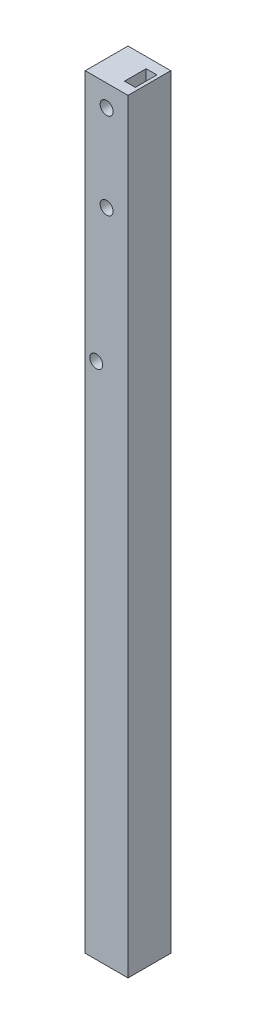
ISO-10303-21;
HEADER;
FILE_DESCRIPTION(('STEP AP214'),'2;1');
FILE_NAME('part.step','',(''),(''),'','','');
FILE_SCHEMA(('AUTOMOTIVE_DESIGN { 1 0 10303 214 1 1 1 1 }'));
ENDSEC;
DATA;
#1=APPLICATION_CONTEXT('core data for automotive mechanical design processes');
#2=APPLICATION_PROTOCOL_DEFINITION('international standard','automotive_design',2000,#1);
#3=PRODUCT_CONTEXT('',#1,'mechanical');
#4=PRODUCT('Part','Part','',(#3));
#5=PRODUCT_RELATED_PRODUCT_CATEGORY('part','',(#4));
#6=PRODUCT_DEFINITION_FORMATION('','',#4);
#7=PRODUCT_DEFINITION_CONTEXT('part definition',#1,'design');
#8=PRODUCT_DEFINITION('design','',#6,#7);
#9=PRODUCT_DEFINITION_SHAPE('','',#8);
#10=(LENGTH_UNIT() NAMED_UNIT(*) SI_UNIT(.MILLI.,.METRE.));
#11=(NAMED_UNIT(*) PLANE_ANGLE_UNIT() SI_UNIT($,.RADIAN.));
#12=(NAMED_UNIT(*) SI_UNIT($,.STERADIAN.) SOLID_ANGLE_UNIT());
#13=UNCERTAINTY_MEASURE_WITH_UNIT(LENGTH_MEASURE(1.E-05),#10,'distance_accuracy_value','');
#14=(GEOMETRIC_REPRESENTATION_CONTEXT(3) GLOBAL_UNCERTAINTY_ASSIGNED_CONTEXT((#13)) GLOBAL_UNIT_ASSIGNED_CONTEXT((#10,
#11,#12)) REPRESENTATION_CONTEXT('',''));
#15=CARTESIAN_POINT('',(0.,0.,0.));
#16=DIRECTION('',(0.,0.,1.));
#17=DIRECTION('',(1.,0.,0.));
#18=AXIS2_PLACEMENT_3D('',#15,#16,#17);
#19=CARTESIAN_POINT('',(0.,177.,0.));
#20=DIRECTION('',(0.,1.,0.));
#21=DIRECTION('',(0.,0.,1.));
#22=AXIS2_PLACEMENT_3D('',#19,#20,#21);
#23=PLANE('',#22);
#24=DIRECTION('',(0.,0.,1.));
#25=VECTOR('',#24,1.);
#26=CARTESIAN_POINT('',(-5.69475822086397,177.,5.05825853992586));
#27=LINE('',#26,#25);
#28=CARTESIAN_POINT('',(-5.69475822086397,177.,-4.84174146007414));
#29=VERTEX_POINT('',#28);
#30=CARTESIAN_POINT('',(-5.69475822086397,177.,5.05825853992586));
#31=VERTEX_POINT('',#30);
#32=EDGE_CURVE('E138',#29,#31,#27,.T.);
#33=ORIENTED_EDGE('',*,*,#32,.T.);
#34=DIRECTION('',(1.,0.,0.));
#35=VECTOR('',#34,1.);
#36=CARTESIAN_POINT('',(4.20524177913603,177.,5.05825853992586));
#37=LINE('',#36,#35);
#38=CARTESIAN_POINT('',(4.20524177913603,177.,5.05825853992586));
#39=VERTEX_POINT('',#38);
#40=EDGE_CURVE('E141',#31,#39,#37,.T.);
#41=ORIENTED_EDGE('',*,*,#40,.T.);
#42=DIRECTION('',(0.,0.,-1.));
#43=VECTOR('',#42,1.);
#44=CARTESIAN_POINT('',(4.20524177913603,177.,5.05825853992586));
#45=LINE('',#44,#43);
#46=CARTESIAN_POINT('',(4.20524177913603,177.,-4.84174146007415));
#47=VERTEX_POINT('',#46);
#48=EDGE_CURVE('E144',#39,#47,#45,.T.);
#49=ORIENTED_EDGE('',*,*,#48,.T.);
#50=DIRECTION('',(-1.,0.,0.));
#51=VECTOR('',#50,1.);
#52=CARTESIAN_POINT('',(4.20524177913603,177.,-4.84174146007415));
#53=LINE('',#52,#51);
#54=EDGE_CURVE('E146',#47,#29,#53,.T.);
#55=ORIENTED_EDGE('',*,*,#54,.T.);
#56=EDGE_LOOP('',(#33,#41,#49,#55));
#57=FACE_BOUND('',#56,.T.);
#58=DIRECTION('',(-1.,0.,0.));
#59=VECTOR('',#58,1.);
#60=CARTESIAN_POINT('',(0.955241779136031,177.,-2.39174146007414));
#61=LINE('',#60,#59);
#62=CARTESIAN_POINT('',(3.45524177913603,177.,-2.39174146007414));
#63=VERTEX_POINT('',#62);
#64=CARTESIAN_POINT('',(0.955241779136031,177.,-2.39174146007414));
#65=VERTEX_POINT('',#64);
#66=EDGE_CURVE('E108',#63,#65,#61,.T.);
#67=ORIENTED_EDGE('',*,*,#66,.F.);
#68=DIRECTION('',(0.,0.,-1.));
#69=VECTOR('',#68,1.);
#70=CARTESIAN_POINT('',(3.45524177913603,177.,-2.39174146007414));
#71=LINE('',#70,#69);
#72=CARTESIAN_POINT('',(3.45524177913603,177.,2.60825853992586));
#73=VERTEX_POINT('',#72);
#74=EDGE_CURVE('E100',#73,#63,#71,.T.);
#75=ORIENTED_EDGE('',*,*,#74,.F.);
#76=DIRECTION('',(1.,0.,0.));
#77=VECTOR('',#76,1.);
#78=CARTESIAN_POINT('',(0.955241779136031,177.,2.60825853992586));
#79=LINE('',#78,#77);
#80=CARTESIAN_POINT('',(0.955241779136031,177.,2.60825853992586));
#81=VERTEX_POINT('',#80);
#82=EDGE_CURVE('E122',#81,#73,#79,.T.);
#83=ORIENTED_EDGE('',*,*,#82,.F.);
#84=DIRECTION('',(0.,0.,1.));
#85=VECTOR('',#84,1.);
#86=CARTESIAN_POINT('',(0.955241779136031,177.,-2.39174146007414));
#87=LINE('',#86,#85);
#88=EDGE_CURVE('E120',#65,#81,#87,.T.);
#89=ORIENTED_EDGE('',*,*,#88,.F.);
#90=EDGE_LOOP('',(#67,#75,#83,#89));
#91=FACE_BOUND('',#90,.T.);
#92=ADVANCED_FACE('F35',(#57,#91),#23,.T.);
#93=CARTESIAN_POINT('',(0.,0.,0.));
#94=DIRECTION('',(0.,1.,0.));
#95=DIRECTION('',(0.,0.,1.));
#96=AXIS2_PLACEMENT_3D('',#93,#94,#95);
#97=PLANE('',#96);
#98=DIRECTION('',(0.,0.,1.));
#99=VECTOR('',#98,1.);
#100=CARTESIAN_POINT('',(-5.69475822086397,0.,5.05825853992586));
#101=LINE('',#100,#99);
#102=CARTESIAN_POINT('',(-5.69475822086397,0.,-4.84174146007414));
#103=VERTEX_POINT('',#102);
#104=CARTESIAN_POINT('',(-5.69475822086397,0.,5.05825853992586));
#105=VERTEX_POINT('',#104);
#106=EDGE_CURVE('E116',#103,#105,#101,.T.);
#107=ORIENTED_EDGE('',*,*,#106,.F.);
#108=DIRECTION('',(-1.,0.,0.));
#109=VECTOR('',#108,1.);
#110=CARTESIAN_POINT('',(4.20524177913603,0.,-4.84174146007415));
#111=LINE('',#110,#109);
#112=CARTESIAN_POINT('',(4.20524177913603,0.,-4.84174146007415));
#113=VERTEX_POINT('',#112);
#114=EDGE_CURVE('E142',#113,#103,#111,.T.);
#115=ORIENTED_EDGE('',*,*,#114,.F.);
#116=DIRECTION('',(0.,0.,-1.));
#117=VECTOR('',#116,1.);
#118=CARTESIAN_POINT('',(4.20524177913603,0.,5.05825853992586));
#119=LINE('',#118,#117);
#120=CARTESIAN_POINT('',(4.20524177913603,0.,5.05825853992586));
#121=VERTEX_POINT('',#120);
#122=EDGE_CURVE('E153',#121,#113,#119,.T.);
#123=ORIENTED_EDGE('',*,*,#122,.F.);
#124=DIRECTION('',(1.,0.,0.));
#125=VECTOR('',#124,1.);
#126=CARTESIAN_POINT('',(4.20524177913603,0.,5.05825853992586));
#127=LINE('',#126,#125);
#128=EDGE_CURVE('E151',#105,#121,#127,.T.);
#129=ORIENTED_EDGE('',*,*,#128,.F.);
#130=EDGE_LOOP('',(#107,#115,#123,#129));
#131=FACE_BOUND('',#130,.T.);
#132=DIRECTION('',(0.,0.,-1.));
#133=VECTOR('',#132,1.);
#134=CARTESIAN_POINT('',(3.45524177913603,0.,-2.39174146007414));
#135=LINE('',#134,#133);
#136=CARTESIAN_POINT('',(3.45524177913603,0.,2.60825853992586));
#137=VERTEX_POINT('',#136);
#138=CARTESIAN_POINT('',(3.45524177913603,0.,-2.39174146007414));
#139=VERTEX_POINT('',#138);
#140=EDGE_CURVE('E58',#137,#139,#135,.T.);
#141=ORIENTED_EDGE('',*,*,#140,.T.);
#142=DIRECTION('',(-1.,0.,0.));
#143=VECTOR('',#142,1.);
#144=CARTESIAN_POINT('',(0.955241779136031,0.,-2.39174146007414));
#145=LINE('',#144,#143);
#146=CARTESIAN_POINT('',(0.955241779136031,0.,-2.39174146007414));
#147=VERTEX_POINT('',#146);
#148=EDGE_CURVE('E115',#139,#147,#145,.T.);
#149=ORIENTED_EDGE('',*,*,#148,.T.);
#150=DIRECTION('',(0.,0.,1.));
#151=VECTOR('',#150,1.);
#152=CARTESIAN_POINT('',(0.955241779136031,0.,-2.39174146007414));
#153=LINE('',#152,#151);
#154=CARTESIAN_POINT('',(0.955241779136031,0.,2.60825853992586));
#155=VERTEX_POINT('',#154);
#156=EDGE_CURVE('E130',#147,#155,#153,.T.);
#157=ORIENTED_EDGE('',*,*,#156,.T.);
#158=DIRECTION('',(1.,0.,0.));
#159=VECTOR('',#158,1.);
#160=CARTESIAN_POINT('',(0.955241779136031,0.,2.60825853992586));
#161=LINE('',#160,#159);
#162=EDGE_CURVE('E109',#155,#137,#161,.T.);
#163=ORIENTED_EDGE('',*,*,#162,.T.);
#164=EDGE_LOOP('',(#141,#149,#157,#163));
#165=FACE_BOUND('',#164,.T.);
#166=ADVANCED_FACE('F171',(#131,#165),#97,.F.);
#167=CARTESIAN_POINT('',(-5.69475822086397,177.,5.05825853992586));
#168=DIRECTION('',(1.,0.,0.));
#169=DIRECTION('',(0.,0.,-1.));
#170=AXIS2_PLACEMENT_3D('',#167,#168,#169);
#171=PLANE('',#170);
#172=ORIENTED_EDGE('',*,*,#106,.T.);
#173=DIRECTION('',(0.,-1.,0.));
#174=VECTOR('',#173,1.);
#175=CARTESIAN_POINT('',(-5.69475822086397,177.,5.05825853992586));
#176=LINE('',#175,#174);
#177=EDGE_CURVE('E11',#31,#105,#176,.T.);
#178=ORIENTED_EDGE('',*,*,#177,.F.);
#179=ORIENTED_EDGE('',*,*,#32,.F.);
#180=DIRECTION('',(0.,-1.,0.));
#181=VECTOR('',#180,1.);
#182=CARTESIAN_POINT('',(-5.69475822086397,177.,-4.84174146007414));
#183=LINE('',#182,#181);
#184=EDGE_CURVE('E148',#29,#103,#183,.T.);
#185=ORIENTED_EDGE('',*,*,#184,.T.);
#186=EDGE_LOOP('',(#172,#178,#179,#185));
#187=FACE_BOUND('',#186,.T.);
#188=ADVANCED_FACE('F37',(#187),#171,.F.);
#189=CARTESIAN_POINT('',(4.20524177913603,177.,5.05825853992586));
#190=DIRECTION('',(0.,0.,-1.));
#191=DIRECTION('',(-1.,0.,0.));
#192=AXIS2_PLACEMENT_3D('',#189,#190,#191);
#193=PLANE('',#192);
#194=CARTESIAN_POINT('',(-3.14475822086397,120.,5.05825853992586));
#195=DIRECTION('',(0.,0.,-1.));
#196=DIRECTION('',(-1.,0.,0.));
#197=AXIS2_PLACEMENT_3D('',#194,#195,#196);
#198=CIRCLE('',#197,1.5);
#199=CARTESIAN_POINT('',(-4.64475822086397,120.,5.05825853992586));
#200=VERTEX_POINT('',#199);
#201=EDGE_CURVE('E217',#200,#200,#198,.T.);
#202=ORIENTED_EDGE('',*,*,#201,.T.);
#203=EDGE_LOOP('',(#202));
#204=FACE_BOUND('',#203,.T.);
#205=CARTESIAN_POINT('',(-0.744758220863973,152.,5.05825853992586));
#206=DIRECTION('',(0.,0.,-1.));
#207=DIRECTION('',(-1.,0.,0.));
#208=AXIS2_PLACEMENT_3D('',#205,#206,#207);
#209=CIRCLE('',#208,1.5);
#210=CARTESIAN_POINT('',(-2.24475822086397,152.,5.05825853992586));
#211=VERTEX_POINT('',#210);
#212=EDGE_CURVE('E223',#211,#211,#209,.T.);
#213=ORIENTED_EDGE('',*,*,#212,.T.);
#214=EDGE_LOOP('',(#213));
#215=FACE_BOUND('',#214,.T.);
#216=CARTESIAN_POINT('',(-0.744758220863949,172.,5.05825853992586));
#217=DIRECTION('',(0.,0.,-1.));
#218=DIRECTION('',(-1.,0.,0.));
#219=AXIS2_PLACEMENT_3D('',#216,#217,#218);
#220=CIRCLE('',#219,1.5);
#221=CARTESIAN_POINT('',(-2.24475822086395,172.,5.05825853992586));
#222=VERTEX_POINT('',#221);
#223=EDGE_CURVE('E128',#222,#222,#220,.T.);
#224=ORIENTED_EDGE('',*,*,#223,.T.);
#225=EDGE_LOOP('',(#224));
#226=FACE_BOUND('',#225,.T.);
#227=ORIENTED_EDGE('',*,*,#128,.T.);
#228=DIRECTION('',(0.,-1.,0.));
#229=VECTOR('',#228,1.);
#230=CARTESIAN_POINT('',(4.20524177913603,177.,5.05825853992586));
#231=LINE('',#230,#229);
#232=EDGE_CURVE('E43',#39,#121,#231,.T.);
#233=ORIENTED_EDGE('',*,*,#232,.F.);
#234=ORIENTED_EDGE('',*,*,#40,.F.);
#235=ORIENTED_EDGE('',*,*,#177,.T.);
#236=EDGE_LOOP('',(#227,#233,#234,#235));
#237=FACE_BOUND('',#236,.T.);
#238=ADVANCED_FACE('F181',(#204,#215,#226,#237),#193,.F.);
#239=CARTESIAN_POINT('',(4.20524177913603,177.,5.05825853992586));
#240=DIRECTION('',(-1.,0.,0.));
#241=DIRECTION('',(0.,0.,1.));
#242=AXIS2_PLACEMENT_3D('',#239,#240,#241);
#243=PLANE('',#242);
#244=ORIENTED_EDGE('',*,*,#122,.T.);
#245=DIRECTION('',(0.,-1.,0.));
#246=VECTOR('',#245,1.);
#247=CARTESIAN_POINT('',(4.20524177913603,177.,-4.84174146007415));
#248=LINE('',#247,#246);
#249=EDGE_CURVE('E158',#47,#113,#248,.T.);
#250=ORIENTED_EDGE('',*,*,#249,.F.);
#251=ORIENTED_EDGE('',*,*,#48,.F.);
#252=ORIENTED_EDGE('',*,*,#232,.T.);
#253=EDGE_LOOP('',(#244,#250,#251,#252));
#254=FACE_BOUND('',#253,.T.);
#255=ADVANCED_FACE('F165',(#254),#243,.F.);
#256=CARTESIAN_POINT('',(4.20524177913603,177.,-4.84174146007415));
#257=DIRECTION('',(0.,0.,1.));
#258=DIRECTION('',(1.,0.,0.));
#259=AXIS2_PLACEMENT_3D('',#256,#257,#258);
#260=PLANE('',#259);
#261=CARTESIAN_POINT('',(-3.14475822086397,120.,-4.84174146007414));
#262=DIRECTION('',(0.,0.,-1.));
#263=DIRECTION('',(-1.,0.,0.));
#264=AXIS2_PLACEMENT_3D('',#261,#262,#263);
#265=CIRCLE('',#264,1.5);
#266=CARTESIAN_POINT('',(-4.64475822086397,120.,-4.84174146007414));
#267=VERTEX_POINT('',#266);
#268=EDGE_CURVE('E208',#267,#267,#265,.T.);
#269=ORIENTED_EDGE('',*,*,#268,.F.);
#270=EDGE_LOOP('',(#269));
#271=FACE_BOUND('',#270,.T.);
#272=CARTESIAN_POINT('',(-0.744758220863975,152.,-4.84174146007415));
#273=DIRECTION('',(0.,0.,-1.));
#274=DIRECTION('',(-1.,0.,0.));
#275=AXIS2_PLACEMENT_3D('',#272,#273,#274);
#276=CIRCLE('',#275,1.5);
#277=CARTESIAN_POINT('',(-2.24475822086398,152.,-4.84174146007415));
#278=VERTEX_POINT('',#277);
#279=EDGE_CURVE('E212',#278,#278,#276,.T.);
#280=ORIENTED_EDGE('',*,*,#279,.F.);
#281=EDGE_LOOP('',(#280));
#282=FACE_BOUND('',#281,.T.);
#283=CARTESIAN_POINT('',(-0.74475822086395,172.,-4.84174146007415));
#284=DIRECTION('',(0.,0.,-1.));
#285=DIRECTION('',(-1.,0.,0.));
#286=AXIS2_PLACEMENT_3D('',#283,#284,#285);
#287=CIRCLE('',#286,1.5);
#288=CARTESIAN_POINT('',(-2.24475822086395,172.,-4.84174146007415));
#289=VERTEX_POINT('',#288);
#290=EDGE_CURVE('E215',#289,#289,#287,.T.);
#291=ORIENTED_EDGE('',*,*,#290,.F.);
#292=EDGE_LOOP('',(#291));
#293=FACE_BOUND('',#292,.T.);
#294=ORIENTED_EDGE('',*,*,#114,.T.);
#295=ORIENTED_EDGE('',*,*,#184,.F.);
#296=ORIENTED_EDGE('',*,*,#54,.F.);
#297=ORIENTED_EDGE('',*,*,#249,.T.);
#298=EDGE_LOOP('',(#294,#295,#296,#297));
#299=FACE_BOUND('',#298,.T.);
#300=ADVANCED_FACE('F175',(#271,#282,#293,#299),#260,.F.);
#301=CARTESIAN_POINT('',(3.45524177913603,177.,-2.39174146007414));
#302=DIRECTION('',(-1.,0.,0.));
#303=DIRECTION('',(0.,0.,1.));
#304=AXIS2_PLACEMENT_3D('',#301,#302,#303);
#305=PLANE('',#304);
#306=ORIENTED_EDGE('',*,*,#140,.F.);
#307=DIRECTION('',(0.,-1.,0.));
#308=VECTOR('',#307,1.);
#309=CARTESIAN_POINT('',(3.45524177913603,177.,2.60825853992586));
#310=LINE('',#309,#308);
#311=EDGE_CURVE('E104',#73,#137,#310,.T.);
#312=ORIENTED_EDGE('',*,*,#311,.F.);
#313=ORIENTED_EDGE('',*,*,#74,.T.);
#314=DIRECTION('',(0.,-1.,0.));
#315=VECTOR('',#314,1.);
#316=CARTESIAN_POINT('',(3.45524177913603,177.,-2.39174146007414));
#317=LINE('',#316,#315);
#318=EDGE_CURVE('E103',#63,#139,#317,.T.);
#319=ORIENTED_EDGE('',*,*,#318,.T.);
#320=EDGE_LOOP('',(#306,#312,#313,#319));
#321=FACE_BOUND('',#320,.T.);
#322=ADVANCED_FACE('F102',(#321),#305,.T.);
#323=CARTESIAN_POINT('',(0.955241779136031,177.,-2.39174146007414));
#324=DIRECTION('',(0.,0.,1.));
#325=DIRECTION('',(1.,0.,0.));
#326=AXIS2_PLACEMENT_3D('',#323,#324,#325);
#327=PLANE('',#326);
#328=ORIENTED_EDGE('',*,*,#148,.F.);
#329=ORIENTED_EDGE('',*,*,#318,.F.);
#330=ORIENTED_EDGE('',*,*,#66,.T.);
#331=DIRECTION('',(0.,-1.,0.));
#332=VECTOR('',#331,1.);
#333=CARTESIAN_POINT('',(0.955241779136031,177.,-2.39174146007414));
#334=LINE('',#333,#332);
#335=EDGE_CURVE('E117',#65,#147,#334,.T.);
#336=ORIENTED_EDGE('',*,*,#335,.T.);
#337=EDGE_LOOP('',(#328,#329,#330,#336));
#338=FACE_BOUND('',#337,.T.);
#339=ADVANCED_FACE('F112',(#338),#327,.T.);
#340=CARTESIAN_POINT('',(0.955241779136031,177.,-2.39174146007414));
#341=DIRECTION('',(1.,0.,0.));
#342=DIRECTION('',(0.,0.,-1.));
#343=AXIS2_PLACEMENT_3D('',#340,#341,#342);
#344=PLANE('',#343);
#345=ORIENTED_EDGE('',*,*,#156,.F.);
#346=ORIENTED_EDGE('',*,*,#335,.F.);
#347=ORIENTED_EDGE('',*,*,#88,.T.);
#348=DIRECTION('',(0.,-1.,0.));
#349=VECTOR('',#348,1.);
#350=CARTESIAN_POINT('',(0.955241779136031,177.,2.60825853992586));
#351=LINE('',#350,#349);
#352=EDGE_CURVE('E50',#81,#155,#351,.T.);
#353=ORIENTED_EDGE('',*,*,#352,.T.);
#354=EDGE_LOOP('',(#345,#346,#347,#353));
#355=FACE_BOUND('',#354,.T.);
#356=ADVANCED_FACE('F246',(#355),#344,.T.);
#357=CARTESIAN_POINT('',(0.955241779136031,177.,2.60825853992586));
#358=DIRECTION('',(0.,0.,-1.));
#359=DIRECTION('',(-1.,0.,0.));
#360=AXIS2_PLACEMENT_3D('',#357,#358,#359);
#361=PLANE('',#360);
#362=ORIENTED_EDGE('',*,*,#162,.F.);
#363=ORIENTED_EDGE('',*,*,#352,.F.);
#364=ORIENTED_EDGE('',*,*,#82,.T.);
#365=ORIENTED_EDGE('',*,*,#311,.T.);
#366=EDGE_LOOP('',(#362,#363,#364,#365));
#367=FACE_BOUND('',#366,.T.);
#368=ADVANCED_FACE('F242',(#367),#361,.T.);
#369=CARTESIAN_POINT('',(-0.744758220863949,172.,5.05825853992586));
#370=DIRECTION('',(0.,0.,-1.));
#371=DIRECTION('',(-1.,0.,0.));
#372=AXIS2_PLACEMENT_3D('',#369,#370,#371);
#373=CYLINDRICAL_SURFACE('',#372,1.5);
#374=ORIENTED_EDGE('',*,*,#223,.F.);
#375=EDGE_LOOP('',(#374));
#376=FACE_BOUND('',#375,.T.);
#377=ORIENTED_EDGE('',*,*,#290,.T.);
#378=EDGE_LOOP('',(#377));
#379=FACE_BOUND('',#378,.T.);
#380=ADVANCED_FACE('F235',(#376,#379),#373,.F.);
#381=CARTESIAN_POINT('',(-0.744758220863973,152.,5.05825853992586));
#382=DIRECTION('',(0.,0.,-1.));
#383=DIRECTION('',(-1.,0.,0.));
#384=AXIS2_PLACEMENT_3D('',#381,#382,#383);
#385=CYLINDRICAL_SURFACE('',#384,1.5);
#386=ORIENTED_EDGE('',*,*,#212,.F.);
#387=EDGE_LOOP('',(#386));
#388=FACE_BOUND('',#387,.T.);
#389=ORIENTED_EDGE('',*,*,#279,.T.);
#390=EDGE_LOOP('',(#389));
#391=FACE_BOUND('',#390,.T.);
#392=ADVANCED_FACE('F229',(#388,#391),#385,.F.);
#393=CARTESIAN_POINT('',(-3.14475822086397,120.,5.05825853992586));
#394=DIRECTION('',(0.,0.,-1.));
#395=DIRECTION('',(-1.,0.,0.));
#396=AXIS2_PLACEMENT_3D('',#393,#394,#395);
#397=CYLINDRICAL_SURFACE('',#396,1.5);
#398=ORIENTED_EDGE('',*,*,#201,.F.);
#399=EDGE_LOOP('',(#398));
#400=FACE_BOUND('',#399,.T.);
#401=ORIENTED_EDGE('',*,*,#268,.T.);
#402=EDGE_LOOP('',(#401));
#403=FACE_BOUND('',#402,.T.);
#404=ADVANCED_FACE('F227',(#400,#403),#397,.F.);
#405=CLOSED_SHELL('',(#92,#166,#188,#238,#255,#300,#322,#339,#356,#368,#380,#392,#404));
#406=MANIFOLD_SOLID_BREP('B2',#405);
#407=ADVANCED_BREP_SHAPE_REPRESENTATION('',(#18,#406),#14);
#408=SHAPE_DEFINITION_REPRESENTATION(#9,#407);
ENDSEC;
END-ISO-10303-21;
